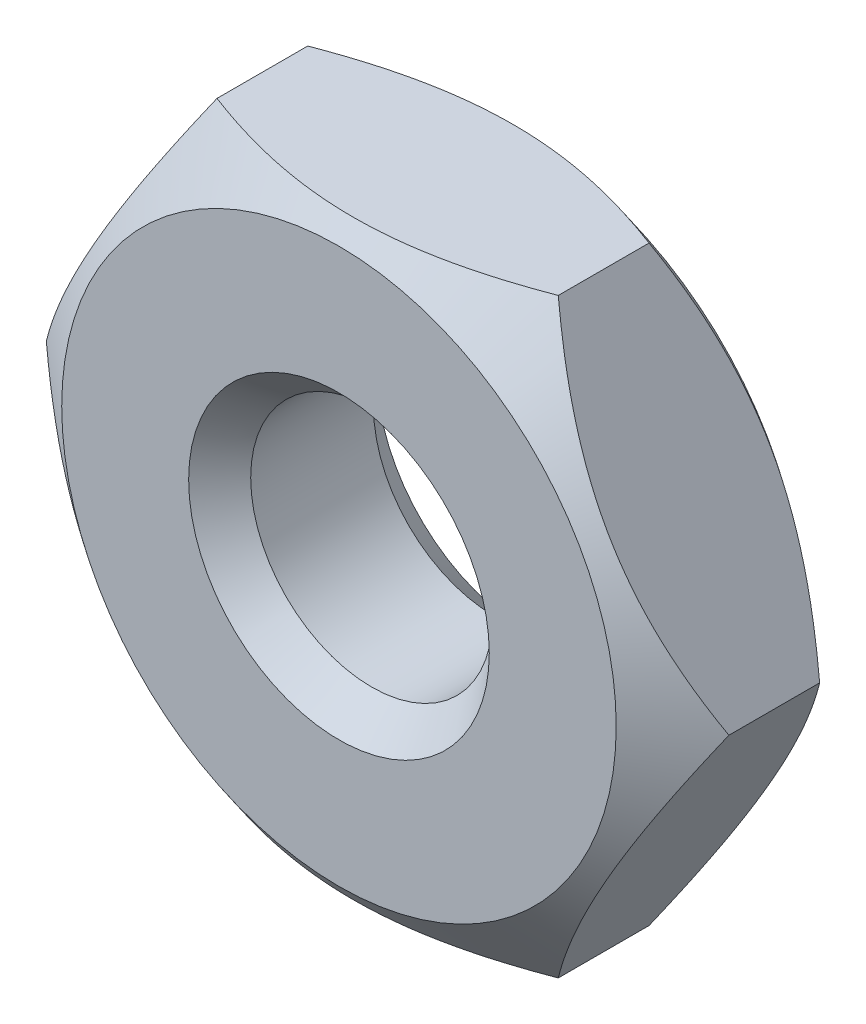
ISO-10303-21;
HEADER;
FILE_DESCRIPTION(('STEP AP214'),'2;1');
FILE_NAME('part.step','',(''),(''),'','','');
FILE_SCHEMA(('AUTOMOTIVE_DESIGN { 1 0 10303 214 1 1 1 1 }'));
ENDSEC;
DATA;
#1=APPLICATION_CONTEXT('core data for automotive mechanical design processes');
#2=APPLICATION_PROTOCOL_DEFINITION('international standard','automotive_design',2000,#1);
#3=PRODUCT_CONTEXT('',#1,'mechanical');
#4=PRODUCT('Part','Part','',(#3));
#5=PRODUCT_RELATED_PRODUCT_CATEGORY('part','',(#4));
#6=PRODUCT_DEFINITION_FORMATION('','',#4);
#7=PRODUCT_DEFINITION_CONTEXT('part definition',#1,'design');
#8=PRODUCT_DEFINITION('design','',#6,#7);
#9=PRODUCT_DEFINITION_SHAPE('','',#8);
#10=(LENGTH_UNIT() NAMED_UNIT(*) SI_UNIT(.MILLI.,.METRE.));
#11=(NAMED_UNIT(*) PLANE_ANGLE_UNIT() SI_UNIT($,.RADIAN.));
#12=(NAMED_UNIT(*) SI_UNIT($,.STERADIAN.) SOLID_ANGLE_UNIT());
#13=UNCERTAINTY_MEASURE_WITH_UNIT(LENGTH_MEASURE(1.E-05),#10,'distance_accuracy_value','');
#14=(GEOMETRIC_REPRESENTATION_CONTEXT(3) GLOBAL_UNCERTAINTY_ASSIGNED_CONTEXT((#13)) GLOBAL_UNIT_ASSIGNED_CONTEXT((#10,
#11,#12)) REPRESENTATION_CONTEXT('',''));
#15=CARTESIAN_POINT('',(0.,0.,0.));
#16=DIRECTION('',(0.,0.,1.));
#17=DIRECTION('',(1.,0.,0.));
#18=AXIS2_PLACEMENT_3D('',#15,#16,#17);
#19=CARTESIAN_POINT('',(0.,0.,0.875));
#20=DIRECTION('',(0.,0.,-1.));
#21=DIRECTION('',(-1.,0.,0.));
#22=AXIS2_PLACEMENT_3D('',#19,#20,#21);
#23=CYLINDRICAL_SURFACE('',#22,1.125);
#24=CARTESIAN_POINT('',(0.,0.,-0.571309556089092));
#25=DIRECTION('',(0.,0.,-1.));
#26=DIRECTION('',(-1.,0.,0.));
#27=AXIS2_PLACEMENT_3D('',#24,#25,#26);
#28=CIRCLE('',#27,1.125);
#29=CARTESIAN_POINT('',(-1.125,0.,-0.571309556089092));
#30=VERTEX_POINT('',#29);
#31=EDGE_CURVE('E45',#30,#30,#28,.T.);
#32=ORIENTED_EDGE('',*,*,#31,.T.);
#33=EDGE_LOOP('',(#32));
#34=FACE_BOUND('',#33,.T.);
#35=CARTESIAN_POINT('',(0.,0.,0.571309556089092));
#36=DIRECTION('',(0.,0.,1.));
#37=DIRECTION('',(1.,0.,0.));
#38=AXIS2_PLACEMENT_3D('',#35,#36,#37);
#39=CIRCLE('',#38,1.125);
#40=CARTESIAN_POINT('',(1.125,0.,0.571309556089092));
#41=VERTEX_POINT('',#40);
#42=EDGE_CURVE('E253',#41,#41,#39,.T.);
#43=ORIENTED_EDGE('',*,*,#42,.T.);
#44=EDGE_LOOP('',(#43));
#45=FACE_BOUND('',#44,.T.);
#46=ADVANCED_FACE('F40',(#34,#45),#23,.F.);
#47=CARTESIAN_POINT('',(3.17542648054294,0.,0.875));
#48=DIRECTION('',(0.,0.,1.));
#49=DIRECTION('',(1.,0.,0.));
#50=AXIS2_PLACEMENT_3D('',#47,#48,#49);
#51=PLANE('',#50);
#52=CARTESIAN_POINT('',(0.,0.,0.875));
#53=DIRECTION('',(0.,0.,-1.));
#54=DIRECTION('',(-1.,0.,0.));
#55=AXIS2_PLACEMENT_3D('',#52,#53,#54);
#56=CIRCLE('',#55,2.57967565803126);
#57=CARTESIAN_POINT('',(-2.57967565803126,0.,0.875));
#58=VERTEX_POINT('',#57);
#59=EDGE_CURVE('E160',#58,#58,#56,.T.);
#60=ORIENTED_EDGE('',*,*,#59,.F.);
#61=EDGE_LOOP('',(#60));
#62=FACE_BOUND('',#61,.T.);
#63=CARTESIAN_POINT('',(0.,0.,0.875));
#64=DIRECTION('',(0.,0.,-1.));
#65=DIRECTION('',(-1.,0.,0.));
#66=AXIS2_PLACEMENT_3D('',#63,#64,#65);
#67=CIRCLE('',#66,1.39869882225736);
#68=CARTESIAN_POINT('',(-1.39869882225736,0.,0.875));
#69=VERTEX_POINT('',#68);
#70=EDGE_CURVE('E255',#69,#69,#67,.T.);
#71=ORIENTED_EDGE('',*,*,#70,.T.);
#72=EDGE_LOOP('',(#71));
#73=FACE_BOUND('',#72,.T.);
#74=ADVANCED_FACE('F261',(#62,#73),#51,.T.);
#75=CARTESIAN_POINT('',(3.17542648054294,0.,-0.875));
#76=DIRECTION('',(0.,0.,1.));
#77=DIRECTION('',(1.,0.,0.));
#78=AXIS2_PLACEMENT_3D('',#75,#76,#77);
#79=PLANE('',#78);
#80=CARTESIAN_POINT('',(0.,0.,-0.875));
#81=DIRECTION('',(0.,0.,-1.));
#82=DIRECTION('',(-1.,0.,0.));
#83=AXIS2_PLACEMENT_3D('',#80,#81,#82);
#84=CIRCLE('',#83,2.57967565803126);
#85=CARTESIAN_POINT('',(-2.57967565803126,0.,-0.875));
#86=VERTEX_POINT('',#85);
#87=EDGE_CURVE('E237',#86,#86,#84,.T.);
#88=ORIENTED_EDGE('',*,*,#87,.T.);
#89=EDGE_LOOP('',(#88));
#90=FACE_BOUND('',#89,.T.);
#91=CARTESIAN_POINT('',(0.,0.,-0.875));
#92=DIRECTION('',(0.,0.,-1.));
#93=DIRECTION('',(-1.,0.,0.));
#94=AXIS2_PLACEMENT_3D('',#91,#92,#93);
#95=CIRCLE('',#94,1.39869882225736);
#96=CARTESIAN_POINT('',(-1.39869882225736,0.,-0.875));
#97=VERTEX_POINT('',#96);
#98=EDGE_CURVE('E250',#97,#97,#95,.T.);
#99=ORIENTED_EDGE('',*,*,#98,.F.);
#100=EDGE_LOOP('',(#99));
#101=FACE_BOUND('',#100,.T.);
#102=ADVANCED_FACE('F148',(#90,#101),#79,.F.);
#103=CARTESIAN_POINT('',(1.58771324027147,-2.75000000000001,0.875));
#104=DIRECTION('',(-0.866025403784439,0.499999999999999,0.));
#105=DIRECTION('',(-0.499999999999999,-0.866025403784439,0.));
#106=AXIS2_PLACEMENT_3D('',#103,#104,#105);
#107=PLANE('',#106);
#108=CARTESIAN_POINT('',(1.58759777021763,-2.75020000000001,0.422160942777373));
#109=CARTESIAN_POINT('',(1.64550190352809,-2.64990709913805,0.466154780551173));
#110=CARTESIAN_POINT('',(1.70405943349325,-2.54848248207265,0.507070178691369));
#111=CARTESIAN_POINT('',(1.82260090158642,-2.34316263653149,0.580973640943661));
#112=CARTESIAN_POINT('',(1.88258869751745,-2.23926072614486,0.613936747312));
#113=CARTESIAN_POINT('',(2.00316905185835,-2.03040942603176,0.66960053153298));
#114=CARTESIAN_POINT('',(2.06375027487333,-1.92547966978516,0.692396697396892));
#115=CARTESIAN_POINT('',(2.18566156560971,-1.71432312021345,0.726413038406155));
#116=CARTESIAN_POINT('',(2.24699060375779,-1.60809811016164,0.737647633324384));
#117=CARTESIAN_POINT('',(2.3707861439042,-1.39367794487763,0.747635248589356));
#118=CARTESIAN_POINT('',(2.43325640751754,-1.28547627433711,0.746208259178316));
#119=CARTESIAN_POINT('',(2.55781965199881,-1.06972640613992,0.730576516202646));
#120=CARTESIAN_POINT('',(2.61991239822633,-0.962178614892368,0.716364499930269));
#121=CARTESIAN_POINT('',(2.74313096480059,-0.748757797149943,0.676454709858134));
#122=CARTESIAN_POINT('',(2.80425695401586,-0.642884478166186,0.650758965445119));
#123=CARTESIAN_POINT('',(2.92526615114008,-0.43329040056392,0.589785702787514));
#124=CARTESIAN_POINT('',(2.98514965998825,-0.329569120703398,0.554510534623646));
#125=CARTESIAN_POINT('',(3.06644185932183,-0.188766901198609,0.500857372308921));
#126=CARTESIAN_POINT('',(3.08841054852007,-0.150716015331571,0.485768789486151));
#127=CARTESIAN_POINT('',(3.13212735753987,-0.0749962809644953,0.45465279438258));
#128=CARTESIAN_POINT('',(3.15387585349002,-0.0373267809906328,0.438627497973258));
#129=CARTESIAN_POINT('',(3.17554195059678,0.000200000000000198,0.42216094277738));
#130=B_SPLINE_CURVE_WITH_KNOTS('',3,(#108,#109,#110,#111,#112,#113,#114,#115,#116,#117,#118,
#119,#120,#121,#122,#123,#124,#125,#126,#127,#128,#129),.UNSPECIFIED.,.F.,.F.,(4,2,2,2,2,2,2,2,
2,2,4),(0.,0.371799405419223,0.744750925949884,1.11412185714032,1.4830315427207,
1.85719432965493,2.23156979914087,2.60587913571533,2.98009672734276,3.11945764890091,
3.2585151082062),.UNSPECIFIED.);
#131=CARTESIAN_POINT('',(1.58771324027145,-2.75000000000001,0.422248701058826));
#132=VERTEX_POINT('',#131);
#133=CARTESIAN_POINT('',(3.17542648054294,0.,0.422248701058826));
#134=VERTEX_POINT('',#133);
#135=EDGE_CURVE('E195',#132,#134,#130,.T.);
#136=ORIENTED_EDGE('',*,*,#135,.F.);
#137=DIRECTION('',(0.,0.,-1.));
#138=VECTOR('',#137,1.);
#139=CARTESIAN_POINT('',(1.58771324027147,-2.75000000000001,0.875));
#140=LINE('',#139,#138);
#141=CARTESIAN_POINT('',(1.58771324027147,-2.75000000000001,-0.42224870105882));
#142=VERTEX_POINT('',#141);
#143=EDGE_CURVE('E66',#132,#142,#140,.T.);
#144=ORIENTED_EDGE('',*,*,#143,.T.);
#145=CARTESIAN_POINT('',(3.17554195059678,0.0002,-0.42216094277738));
#146=CARTESIAN_POINT('',(3.11763781728632,-0.100092900861959,-0.466154780551179));
#147=CARTESIAN_POINT('',(3.05908028732116,-0.201517517927356,-0.507070178691375));
#148=CARTESIAN_POINT('',(2.940538819228,-0.406837363468517,-0.580973640943666));
#149=CARTESIAN_POINT('',(2.88055102329696,-0.510739273855143,-0.613936747312004));
#150=CARTESIAN_POINT('',(2.75997066895606,-0.719590573968245,-0.669600531532983));
#151=CARTESIAN_POINT('',(2.69938944594108,-0.824520330214851,-0.692396697396895));
#152=CARTESIAN_POINT('',(2.5774781552047,-1.03567687978656,-0.726413038406157));
#153=CARTESIAN_POINT('',(2.51614911705662,-1.14190188983837,-0.737647633324385));
#154=CARTESIAN_POINT('',(2.39235357691021,-1.35632205512237,-0.747635248589356));
#155=CARTESIAN_POINT('',(2.32988331329688,-1.4645237256629,-0.746208259178315));
#156=CARTESIAN_POINT('',(2.20532006881561,-1.68027359386008,-0.730576516202645));
#157=CARTESIAN_POINT('',(2.14322732258808,-1.78782138510764,-0.716364499930268));
#158=CARTESIAN_POINT('',(2.02000875601382,-2.00124220285006,-0.676454709858132));
#159=CARTESIAN_POINT('',(1.95888276679855,-2.10711552183382,-0.650758965445117));
#160=CARTESIAN_POINT('',(1.83787356967433,-2.31670959943608,-0.589785702787512));
#161=CARTESIAN_POINT('',(1.77799006082617,-2.4204308792966,-0.554510534623644));
#162=CARTESIAN_POINT('',(1.69669786149258,-2.56123309880139,-0.500857372308919));
#163=CARTESIAN_POINT('',(1.67472917229434,-2.59928398466843,-0.485768789486148));
#164=CARTESIAN_POINT('',(1.63101236327454,-2.67500371903551,-0.454652794382575));
#165=CARTESIAN_POINT('',(1.60926386732439,-2.71267321900938,-0.438627497973252));
#166=CARTESIAN_POINT('',(1.58759777021763,-2.75020000000001,-0.422160942777374));
#167=B_SPLINE_CURVE_WITH_KNOTS('',3,(#145,#146,#147,#148,#149,#150,#151,#152,#153,#154,#155,
#156,#157,#158,#159,#160,#161,#162,#163,#164,#165,#166),.UNSPECIFIED.,.F.,.F.,(4,2,2,2,2,2,2,2,
2,2,4),(0.,0.371799405419222,0.744750925949881,1.11412185714032,1.4830315427207,
1.85719432965492,2.23156979914086,2.60587913571532,2.98009672734275,3.11945764890091,
3.2585151082062),.UNSPECIFIED.);
#168=CARTESIAN_POINT('',(3.17542648054294,0.,-0.422248701058826));
#169=VERTEX_POINT('',#168);
#170=EDGE_CURVE('E218',#169,#142,#167,.T.);
#171=ORIENTED_EDGE('',*,*,#170,.F.);
#172=DIRECTION('',(0.,0.,-1.));
#173=VECTOR('',#172,1.);
#174=CARTESIAN_POINT('',(3.17542648054294,0.,0.875));
#175=LINE('',#174,#173);
#176=EDGE_CURVE('E51',#134,#169,#175,.T.);
#177=ORIENTED_EDGE('',*,*,#176,.F.);
#178=EDGE_LOOP('',(#136,#144,#171,#177));
#179=FACE_BOUND('',#178,.T.);
#180=ADVANCED_FACE('F42',(#179),#107,.F.);
#181=CARTESIAN_POINT('',(3.17542648054294,0.,0.875));
#182=DIRECTION('',(-0.86602540378444,-0.499999999999998,0.));
#183=DIRECTION('',(0.499999999999998,-0.86602540378444,0.));
#184=AXIS2_PLACEMENT_3D('',#181,#182,#183);
#185=PLANE('',#184);
#186=CARTESIAN_POINT('',(3.17554195059678,-0.000200000000000048,0.42216094277738));
#187=CARTESIAN_POINT('',(3.11763781728632,0.100092900861959,0.466154780551179));
#188=CARTESIAN_POINT('',(3.05908028732116,0.201517517927356,0.507070178691375));
#189=CARTESIAN_POINT('',(2.940538819228,0.406837363468517,0.580973640943666));
#190=CARTESIAN_POINT('',(2.88055102329696,0.510739273855144,0.613936747312004));
#191=CARTESIAN_POINT('',(2.75997066895606,0.719590573968245,0.669600531532982));
#192=CARTESIAN_POINT('',(2.69938944594108,0.824520330214851,0.692396697396894));
#193=CARTESIAN_POINT('',(2.5774781552047,1.03567687978656,0.726413038406156));
#194=CARTESIAN_POINT('',(2.51614911705662,1.14190188983837,0.737647633324384));
#195=CARTESIAN_POINT('',(2.39235357691022,1.35632205512238,0.747635248589355));
#196=CARTESIAN_POINT('',(2.32988331329688,1.4645237256629,0.746208259178314));
#197=CARTESIAN_POINT('',(2.20532006881561,1.68027359386008,0.730576516202643));
#198=CARTESIAN_POINT('',(2.14322732258808,1.78782138510764,0.716364499930266));
#199=CARTESIAN_POINT('',(2.02000875601383,2.00124220285006,0.67645470985813));
#200=CARTESIAN_POINT('',(1.95888276679856,2.10711552183382,0.650758965445115));
#201=CARTESIAN_POINT('',(1.83787356967434,2.31670959943608,0.58978570278751));
#202=CARTESIAN_POINT('',(1.77799006082617,2.4204308792966,0.554510534623642));
#203=CARTESIAN_POINT('',(1.69669786149259,2.56123309880139,0.500857372308917));
#204=CARTESIAN_POINT('',(1.67472917229435,2.59928398466843,0.485768789486145));
#205=CARTESIAN_POINT('',(1.63101236327455,2.67500371903552,0.454652794382572));
#206=CARTESIAN_POINT('',(1.6092638673244,2.71267321900938,0.438627497973248));
#207=CARTESIAN_POINT('',(1.58759777021763,2.75020000000002,0.422160942777369));
#208=B_SPLINE_CURVE_WITH_KNOTS('',3,(#186,#187,#188,#189,#190,#191,#192,#193,#194,#195,#196,
#197,#198,#199,#200,#201,#202,#203,#204,#205,#206,#207),.UNSPECIFIED.,.F.,.F.,(4,2,2,2,2,2,2,2,
2,2,4),(0.,0.371799405419221,0.744750925949881,1.11412185714032,1.4830315427207,
1.85719432965492,2.23156979914086,2.60587913571532,2.98009672734275,3.11945764890091,
3.2585151082062),.UNSPECIFIED.);
#209=CARTESIAN_POINT('',(1.58771324027144,2.75000000000002,0.422248701058826));
#210=VERTEX_POINT('',#209);
#211=EDGE_CURVE('E189',#134,#210,#208,.T.);
#212=ORIENTED_EDGE('',*,*,#211,.F.);
#213=ORIENTED_EDGE('',*,*,#176,.T.);
#214=CARTESIAN_POINT('',(1.58759777021763,2.75020000000002,-0.422160942777368));
#215=CARTESIAN_POINT('',(1.64550190352809,2.64990709913806,-0.466154780551169));
#216=CARTESIAN_POINT('',(1.70405943349325,2.54848248207266,-0.507070178691365));
#217=CARTESIAN_POINT('',(1.82260090158642,2.3431626365315,-0.580973640943658));
#218=CARTESIAN_POINT('',(1.88258869751745,2.23926072614487,-0.613936747311997));
#219=CARTESIAN_POINT('',(2.00316905185835,2.03040942603177,-0.669600531532977));
#220=CARTESIAN_POINT('',(2.06375027487333,1.92547966978516,-0.69239669739689));
#221=CARTESIAN_POINT('',(2.18566156560971,1.71432312021345,-0.726413038406153));
#222=CARTESIAN_POINT('',(2.24699060375779,1.60809811016164,-0.737647633324382));
#223=CARTESIAN_POINT('',(2.3707861439042,1.39367794487763,-0.747635248589355));
#224=CARTESIAN_POINT('',(2.43325640751754,1.28547627433711,-0.746208259178315));
#225=CARTESIAN_POINT('',(2.55781965199881,1.06972640613993,-0.730576516202645));
#226=CARTESIAN_POINT('',(2.61991239822633,0.962178614892368,-0.716364499930268));
#227=CARTESIAN_POINT('',(2.74313096480059,0.748757797149942,-0.676454709858133));
#228=CARTESIAN_POINT('',(2.80425695401586,0.642884478166185,-0.650758965445118));
#229=CARTESIAN_POINT('',(2.92526615114008,0.433290400563918,-0.589785702787513));
#230=CARTESIAN_POINT('',(2.98514965998825,0.329569120703396,-0.554510534623645));
#231=CARTESIAN_POINT('',(3.06644185932183,0.188766901198607,-0.500857372308921));
#232=CARTESIAN_POINT('',(3.08841054852007,0.15071601533157,-0.485768789486151));
#233=CARTESIAN_POINT('',(3.13212735753987,0.0749962809644946,-0.45465279438258));
#234=CARTESIAN_POINT('',(3.15387585349002,0.0373267809906325,-0.438627497973258));
#235=CARTESIAN_POINT('',(3.17554195059678,-0.000200000000000123,-0.42216094277738));
#236=B_SPLINE_CURVE_WITH_KNOTS('',3,(#214,#215,#216,#217,#218,#219,#220,#221,#222,#223,#224,
#225,#226,#227,#228,#229,#230,#231,#232,#233,#234,#235),.UNSPECIFIED.,.F.,.F.,(4,2,2,2,2,2,2,2,
2,2,4),(0.,0.371799405419223,0.744750925949886,1.11412185714033,1.48303154272071,
1.85719432965493,2.23156979914087,2.60587913571534,2.98009672734277,3.11945764890092,
3.2585151082062),.UNSPECIFIED.);
#237=CARTESIAN_POINT('',(1.58771324027144,2.75000000000002,-0.422248701058826));
#238=VERTEX_POINT('',#237);
#239=EDGE_CURVE('E209',#238,#169,#236,.T.);
#240=ORIENTED_EDGE('',*,*,#239,.F.);
#241=DIRECTION('',(0.,0.,-1.));
#242=VECTOR('',#241,1.);
#243=CARTESIAN_POINT('',(1.58771324027147,2.75000000000002,0.875));
#244=LINE('',#243,#242);
#245=EDGE_CURVE('E124',#210,#238,#244,.T.);
#246=ORIENTED_EDGE('',*,*,#245,.F.);
#247=EDGE_LOOP('',(#212,#213,#240,#246));
#248=FACE_BOUND('',#247,.T.);
#249=ADVANCED_FACE('F201',(#248),#185,.F.);
#250=CARTESIAN_POINT('',(1.58771324027147,2.75000000000002,0.875));
#251=DIRECTION('',(0.,-1.,0.));
#252=DIRECTION('',(1.,0.,0.));
#253=AXIS2_PLACEMENT_3D('',#250,#251,#252);
#254=PLANE('',#253);
#255=CARTESIAN_POINT('',(-3.67639026227045,2.75000000000001,-0.653629345424159));
#256=CARTESIAN_POINT('',(-3.57939501129828,2.75000000000001,-0.594617392693888));
#257=CARTESIAN_POINT('',(-3.48203582798054,2.75000000000001,-0.536193521287553));
#258=CARTESIAN_POINT('',(-3.28642450050147,2.75000000000001,-0.42081469241309));
#259=CARTESIAN_POINT('',(-3.18817217412981,2.75000000000001,-0.36386004420957));
#260=CARTESIAN_POINT('',(-2.98999312864294,2.75000000000001,-0.251364526704245));
#261=CARTESIAN_POINT('',(-2.89005961993059,2.75000000000001,-0.195835576816778));
#262=CARTESIAN_POINT('',(-2.68898605542339,2.75000000000001,-0.0870141128607656));
#263=CARTESIAN_POINT('',(-2.58784607099461,2.75000000000001,-0.0337214673434778));
#264=CARTESIAN_POINT('',(-2.37960467735443,2.75000000000001,0.072406444143973));
#265=CARTESIAN_POINT('',(-2.27243853410877,2.75000000000001,0.125115368284265));
#266=CARTESIAN_POINT('',(-2.05628130729264,2.75000000000001,0.22671280170422));
#267=CARTESIAN_POINT('',(-1.94728998776978,2.75000000000001,0.275600812327037));
#268=CARTESIAN_POINT('',(-1.72750553308581,2.75000000000001,0.368389098401357));
#269=CARTESIAN_POINT('',(-1.61671756350507,2.75000000000001,0.412301496884643));
#270=CARTESIAN_POINT('',(-1.39290793086001,2.75000000000001,0.493947856122555));
#271=CARTESIAN_POINT('',(-1.27988710994013,2.75000000000001,0.531684098243662));
#272=CARTESIAN_POINT('',(-1.04800611827853,2.75000000000001,0.600456106444395));
#273=CARTESIAN_POINT('',(-0.929073172911555,2.75000000000001,0.631250828500203));
#274=CARTESIAN_POINT('',(-0.689007289038234,2.75000000000001,0.682735436264609));
#275=CARTESIAN_POINT('',(-0.56787464028896,2.75000000000001,0.703426642992347));
#276=CARTESIAN_POINT('',(-0.326182637619097,2.75000000000001,0.732827144583061));
#277=CARTESIAN_POINT('',(-0.205647505779988,2.75000000000001,0.741730810434299));
#278=CARTESIAN_POINT('',(0.0357156540375103,2.75000000000001,0.747392674786314));
#279=CARTESIAN_POINT('',(0.156543674845617,2.75000000000002,0.744151167673998));
#280=CARTESIAN_POINT('',(0.388111009280242,2.75000000000002,0.726527441798538));
#281=CARTESIAN_POINT('',(0.498918749822064,2.75000000000002,0.713011218969894));
#282=CARTESIAN_POINT('',(0.719012011841308,2.75000000000002,0.676851287726835));
#283=CARTESIAN_POINT('',(0.828297434040084,2.75000000000002,0.654206986877306));
#284=CARTESIAN_POINT('',(1.04701988751654,2.75000000000002,0.600620685026126));
#285=CARTESIAN_POINT('',(1.15641934493609,2.75000000000002,0.569527353115695));
#286=CARTESIAN_POINT('',(1.31890175806598,2.75000000000002,0.517932490777469));
#287=CARTESIAN_POINT('',(1.37279205976384,2.75000000000002,0.499908794444988));
#288=CARTESIAN_POINT('',(1.48005179464635,2.75000000000002,0.462375966007029));
#289=CARTESIAN_POINT('',(1.53342124441932,2.75000000000002,0.442866881384174));
#290=CARTESIAN_POINT('',(1.69029471405982,2.75000000000002,0.383292278875777));
#291=CARTESIAN_POINT('',(1.79309120578908,2.75000000000002,0.341359692569031));
#292=CARTESIAN_POINT('',(1.99694995326802,2.75000000000002,0.253451046332255));
#293=CARTESIAN_POINT('',(2.09801178771731,2.75000000000002,0.207474020272746));
#294=CARTESIAN_POINT('',(2.29867974831897,2.75000000000002,0.112252563995711));
#295=CARTESIAN_POINT('',(2.39828460282512,2.75000000000002,0.0630054657224356));
#296=CARTESIAN_POINT('',(2.59616650348701,2.75000000000002,-0.0380950463402421));
#297=CARTESIAN_POINT('',(2.69444343409318,2.75000000000002,-0.0899486851087005));
#298=CARTESIAN_POINT('',(2.98844733565992,2.75000000000002,-0.249122310723766));
#299=CARTESIAN_POINT('',(3.18245250184789,2.75000000000002,-0.359619066196852));
#300=CARTESIAN_POINT('',(3.56701552268731,2.75000000000002,-0.586193844526677));
#301=CARTESIAN_POINT('',(3.75757489705958,2.75000000000002,-0.702269320040532));
#302=CARTESIAN_POINT('',(4.11730397019956,2.75000000000002,-0.92657892884701));
#303=CARTESIAN_POINT('',(4.28670850108432,2.75000000000002,-1.03443778276285));
#304=CARTESIAN_POINT('',(4.62398914916442,2.75000000000002,-1.25255831219244));
#305=CARTESIAN_POINT('',(4.79186507188298,2.75000000000002,-1.36282028755043));
#306=CARTESIAN_POINT('',(5.12475753602754,2.75000000000002,-1.58406458188025));
#307=CARTESIAN_POINT('',(5.28978595014131,2.75000000000002,-1.69502907875624));
#308=CARTESIAN_POINT('',(5.61885275626859,2.75000000000002,-1.91834687055425));
#309=CARTESIAN_POINT('',(5.78289134049976,2.75000000000002,-2.03069988201465));
#310=CARTESIAN_POINT('',(5.94656625671991,2.75000000000002,-2.14357353525307));
#311=B_SPLINE_CURVE_WITH_KNOTS('',3,(#255,#256,#257,#258,#259,#260,#261,#262,#263,#264,#265,
#266,#267,#268,#269,#270,#271,#272,#273,#274,#275,#276,#277,#278,#279,#280,#281,#282,#283,#284,
#285,#286,#287,#288,#289,#290,#291,#292,#293,#294,#295,#296,#297,#298,#299,#300,#301,#302,#303,
#304,#305,#306,#307,#308,#309,#310),.UNSPECIFIED.,.F.,.F.,(4,2,2,2,2,2,2,2,2,2,2,2,2,2,2,2,2,2,
2,2,2,2,2,2,2,2,2,4),(0.,0.340614587055066,0.681300296316607,1.02425142553785,1.36718236796196,
1.72540375915339,2.08367182303179,2.44104729484458,2.79829045887623,3.16649200909567,
3.53464540462769,3.89664921580122,4.25864425241936,4.59310965285521,4.92759676442877,
5.26852236145616,5.43897847754409,5.60942914703719,5.9423693756515,6.27538935361335,
6.60868446335739,6.94200839045796,7.61163970232217,8.28096810096076,8.88342208827953,
9.48595168076807,10.0825403558946,10.679009187391),.UNSPECIFIED.);
#312=CARTESIAN_POINT('',(-1.58771324027148,2.75,0.422248701058826));
#313=VERTEX_POINT('',#312);
#314=EDGE_CURVE('E99',#210,#313,#311,.F.);
#315=ORIENTED_EDGE('',*,*,#314,.F.);
#316=ORIENTED_EDGE('',*,*,#245,.T.);
#317=CARTESIAN_POINT('',(-3.67639026227045,2.75000000000001,0.653629345424161));
#318=CARTESIAN_POINT('',(-3.57939501129829,2.75000000000001,0.59461739269389));
#319=CARTESIAN_POINT('',(-3.48203582798055,2.75000000000001,0.536193521287554));
#320=CARTESIAN_POINT('',(-3.28642450050147,2.75000000000001,0.420814692413091));
#321=CARTESIAN_POINT('',(-3.18817217412981,2.75000000000001,0.363860044209571));
#322=CARTESIAN_POINT('',(-2.98999312864294,2.75000000000001,0.251364526704245));
#323=CARTESIAN_POINT('',(-2.89005961993059,2.75000000000001,0.195835576816778));
#324=CARTESIAN_POINT('',(-2.6889860554234,2.75000000000001,0.0870141128607663));
#325=CARTESIAN_POINT('',(-2.58784607099461,2.75000000000001,0.033721467343479));
#326=CARTESIAN_POINT('',(-2.37960467735444,2.75000000000001,-0.0724064441439715));
#327=CARTESIAN_POINT('',(-2.27243853410877,2.75000000000001,-0.125115368284264));
#328=CARTESIAN_POINT('',(-2.05628130729264,2.75000000000001,-0.226712801704219));
#329=CARTESIAN_POINT('',(-1.94728998776979,2.75000000000001,-0.275600812327036));
#330=CARTESIAN_POINT('',(-1.72750553308582,2.75000000000001,-0.368389098401357));
#331=CARTESIAN_POINT('',(-1.61671756350507,2.75000000000001,-0.412301496884643));
#332=CARTESIAN_POINT('',(-1.39290793086001,2.75000000000001,-0.493947856122555));
#333=CARTESIAN_POINT('',(-1.27988710994014,2.75000000000001,-0.531684098243662));
#334=CARTESIAN_POINT('',(-1.04800611827853,2.75000000000001,-0.600456106444395));
#335=CARTESIAN_POINT('',(-0.929073172911555,2.75000000000001,-0.631250828500203));
#336=CARTESIAN_POINT('',(-0.689007289038234,2.75000000000001,-0.682735436264609));
#337=CARTESIAN_POINT('',(-0.567874640288959,2.75000000000001,-0.703426642992347));
#338=CARTESIAN_POINT('',(-0.326182637619096,2.75000000000001,-0.732827144583061));
#339=CARTESIAN_POINT('',(-0.205647505779987,2.75000000000001,-0.741730810434299));
#340=CARTESIAN_POINT('',(0.0357156540375112,2.75000000000001,-0.747392674786314));
#341=CARTESIAN_POINT('',(0.156543674845618,2.75000000000002,-0.744151167673998));
#342=CARTESIAN_POINT('',(0.388111009280243,2.75000000000002,-0.726527441798539));
#343=CARTESIAN_POINT('',(0.498918749822065,2.75000000000002,-0.713011218969895));
#344=CARTESIAN_POINT('',(0.719012011841309,2.75000000000002,-0.676851287726835));
#345=CARTESIAN_POINT('',(0.828297434040084,2.75000000000002,-0.654206986877306));
#346=CARTESIAN_POINT('',(1.04701988751654,2.75000000000002,-0.600620685026125));
#347=CARTESIAN_POINT('',(1.15641934493609,2.75000000000002,-0.569527353115695));
#348=CARTESIAN_POINT('',(1.31890175806598,2.75000000000002,-0.517932490777469));
#349=CARTESIAN_POINT('',(1.37279205976384,2.75000000000002,-0.499908794444988));
#350=CARTESIAN_POINT('',(1.48005179464635,2.75000000000002,-0.462375966007028));
#351=CARTESIAN_POINT('',(1.53342124441933,2.75000000000002,-0.442866881384174));
#352=CARTESIAN_POINT('',(1.69029471405982,2.75000000000002,-0.383292278875777));
#353=CARTESIAN_POINT('',(1.79309120578908,2.75000000000002,-0.34135969256903));
#354=CARTESIAN_POINT('',(1.99694995326802,2.75000000000002,-0.253451046332254));
#355=CARTESIAN_POINT('',(2.09801178771731,2.75000000000002,-0.207474020272744));
#356=CARTESIAN_POINT('',(2.29867974831898,2.75000000000002,-0.112252563995709));
#357=CARTESIAN_POINT('',(2.39828460282513,2.75000000000002,-0.0630054657224342));
#358=CARTESIAN_POINT('',(2.59616650348701,2.75000000000002,0.0380950463402438));
#359=CARTESIAN_POINT('',(2.69444343409319,2.75000000000002,0.0899486851087025));
#360=CARTESIAN_POINT('',(2.98844733565993,2.75000000000002,0.249122310723768));
#361=CARTESIAN_POINT('',(3.18245250184789,2.75000000000002,0.359619066196855));
#362=CARTESIAN_POINT('',(3.56701552268731,2.75000000000002,0.58619384452668));
#363=CARTESIAN_POINT('',(3.75757489705958,2.75000000000002,0.702269320040535));
#364=CARTESIAN_POINT('',(4.11730397019957,2.75000000000002,0.926578928847013));
#365=CARTESIAN_POINT('',(4.28670850108433,2.75000000000002,1.03443778276286));
#366=CARTESIAN_POINT('',(4.62398914916442,2.75000000000002,1.25255831219245));
#367=CARTESIAN_POINT('',(4.79186507188299,2.75000000000002,1.36282028755043));
#368=CARTESIAN_POINT('',(5.12475753602755,2.75000000000002,1.58406458188026));
#369=CARTESIAN_POINT('',(5.28978595014132,2.75000000000002,1.69502907875624));
#370=CARTESIAN_POINT('',(5.61885275626859,2.75000000000002,1.91834687055426));
#371=CARTESIAN_POINT('',(5.78289134049977,2.75000000000002,2.03069988201466));
#372=CARTESIAN_POINT('',(5.94656625671992,2.75000000000002,2.14357353525308));
#373=B_SPLINE_CURVE_WITH_KNOTS('',3,(#317,#318,#319,#320,#321,#322,#323,#324,#325,#326,#327,
#328,#329,#330,#331,#332,#333,#334,#335,#336,#337,#338,#339,#340,#341,#342,#343,#344,#345,#346,
#347,#348,#349,#350,#351,#352,#353,#354,#355,#356,#357,#358,#359,#360,#361,#362,#363,#364,#365,
#366,#367,#368,#369,#370,#371,#372),.UNSPECIFIED.,.F.,.F.,(4,2,2,2,2,2,2,2,2,2,2,2,2,2,2,2,2,2,
2,2,2,2,2,2,2,2,2,4),(0.,0.340614587055067,0.681300296316607,1.02425142553786,1.36718236796196,
1.72540375915339,2.08367182303179,2.44104729484458,2.79829045887623,3.16649200909567,
3.5346454046277,3.89664921580123,4.25864425241937,4.59310965285522,4.92759676442878,
5.26852236145616,5.43897847754409,5.60942914703719,5.9423693756515,6.27538935361336,
6.60868446335739,6.94200839045797,7.61163970232218,8.28096810096077,8.88342208827954,
9.48595168076808,10.0825403558947,10.679009187391),.UNSPECIFIED.);
#374=CARTESIAN_POINT('',(-1.58771324027148,2.75,-0.422248701058826));
#375=VERTEX_POINT('',#374);
#376=EDGE_CURVE('E219',#375,#238,#373,.T.);
#377=ORIENTED_EDGE('',*,*,#376,.F.);
#378=DIRECTION('',(0.,0.,-1.));
#379=VECTOR('',#378,1.);
#380=CARTESIAN_POINT('',(-1.58771324027147,2.75000000000001,0.875));
#381=LINE('',#380,#379);
#382=EDGE_CURVE('E120',#313,#375,#381,.T.);
#383=ORIENTED_EDGE('',*,*,#382,.F.);
#384=EDGE_LOOP('',(#315,#316,#377,#383));
#385=FACE_BOUND('',#384,.T.);
#386=ADVANCED_FACE('F204',(#385),#254,.F.);
#387=CARTESIAN_POINT('',(-1.58771324027147,2.75000000000001,0.875));
#388=DIRECTION('',(0.866025403784439,-0.499999999999999,0.));
#389=DIRECTION('',(0.499999999999999,0.866025403784439,0.));
#390=AXIS2_PLACEMENT_3D('',#387,#388,#389);
#391=PLANE('',#390);
#392=CARTESIAN_POINT('',(-1.58759777021763,2.75020000000001,0.422160942777372));
#393=CARTESIAN_POINT('',(-1.64550190352809,2.64990709913805,0.466154780551172));
#394=CARTESIAN_POINT('',(-1.70405943349325,2.54848248207266,0.507070178691369));
#395=CARTESIAN_POINT('',(-1.82260090158641,2.34316263653149,0.580973640943661));
#396=CARTESIAN_POINT('',(-1.88258869751745,2.23926072614487,0.613936747312));
#397=CARTESIAN_POINT('',(-2.00316905185835,2.03040942603177,0.66960053153298));
#398=CARTESIAN_POINT('',(-2.06375027487333,1.92547966978516,0.692396697396892));
#399=CARTESIAN_POINT('',(-2.18566156560971,1.71432312021345,0.726413038406155));
#400=CARTESIAN_POINT('',(-2.24699060375779,1.60809811016164,0.737647633324384));
#401=CARTESIAN_POINT('',(-2.3707861439042,1.39367794487763,0.747635248589356));
#402=CARTESIAN_POINT('',(-2.43325640751753,1.28547627433711,0.746208259178316));
#403=CARTESIAN_POINT('',(-2.55781965199881,1.06972640613993,0.730576516202646));
#404=CARTESIAN_POINT('',(-2.61991239822633,0.962178614892369,0.716364499930269));
#405=CARTESIAN_POINT('',(-2.74313096480059,0.748757797149944,0.676454709858134));
#406=CARTESIAN_POINT('',(-2.80425695401586,0.642884478166187,0.650758965445119));
#407=CARTESIAN_POINT('',(-2.92526615114008,0.433290400563921,0.589785702787514));
#408=CARTESIAN_POINT('',(-2.98514965998825,0.329569120703399,0.554510534623645));
#409=CARTESIAN_POINT('',(-3.06644185932183,0.188766901198608,0.500857372308921));
#410=CARTESIAN_POINT('',(-3.08841054852007,0.150716015331569,0.48576878948615));
#411=CARTESIAN_POINT('',(-3.13212735753987,0.0749962809644887,0.454652794382577));
#412=CARTESIAN_POINT('',(-3.15387585349002,0.0373267809906242,0.438627497973254));
#413=CARTESIAN_POINT('',(-3.17554195059679,-0.000200000000010635,0.422160942777375));
#414=B_SPLINE_CURVE_WITH_KNOTS('',3,(#392,#393,#394,#395,#396,#397,#398,#399,#400,#401,#402,
#403,#404,#405,#406,#407,#408,#409,#410,#411,#412,#413),.UNSPECIFIED.,.F.,.F.,(4,2,2,2,2,2,2,2,
2,2,4),(0.,0.371799405419224,0.744750925949885,1.11412185714033,1.48303154272071,
1.85719432965493,2.23156979914087,2.60587913571534,2.98009672734277,3.11945764890093,
3.25851510820622),.UNSPECIFIED.);
#415=CARTESIAN_POINT('',(-3.17542648054294,0.,0.422248701058826));
#416=VERTEX_POINT('',#415);
#417=EDGE_CURVE('E96',#313,#416,#414,.T.);
#418=ORIENTED_EDGE('',*,*,#417,.F.);
#419=ORIENTED_EDGE('',*,*,#382,.T.);
#420=CARTESIAN_POINT('',(-3.17554195059679,-0.000200000000010499,-0.422160942777375));
#421=CARTESIAN_POINT('',(-3.11763781728633,0.100092900861949,-0.466154780551175));
#422=CARTESIAN_POINT('',(-3.05908028732116,0.201517517927346,-0.507070178691371));
#423=CARTESIAN_POINT('',(-2.940538819228,0.406837363468507,-0.580973640943663));
#424=CARTESIAN_POINT('',(-2.88055102329697,0.510739273855134,-0.613936747312002));
#425=CARTESIAN_POINT('',(-2.75997066895606,0.719590573968236,-0.669600531532981));
#426=CARTESIAN_POINT('',(-2.69938944594108,0.824520330214842,-0.692396697396893));
#427=CARTESIAN_POINT('',(-2.57747815520471,1.03567687978655,-0.726413038406156));
#428=CARTESIAN_POINT('',(-2.51614911705662,1.14190188983836,-0.737647633324384));
#429=CARTESIAN_POINT('',(-2.39235357691022,1.35632205512237,-0.747635248589356));
#430=CARTESIAN_POINT('',(-2.32988331329688,1.46452372566289,-0.746208259178316));
#431=CARTESIAN_POINT('',(-2.20532006881561,1.68027359386007,-0.730576516202646));
#432=CARTESIAN_POINT('',(-2.14322732258808,1.78782138510763,-0.716364499930269));
#433=CARTESIAN_POINT('',(-2.02000875601383,2.00124220285005,-0.676454709858134));
#434=CARTESIAN_POINT('',(-1.95888276679855,2.10711552183381,-0.650758965445119));
#435=CARTESIAN_POINT('',(-1.83787356967434,2.31670959943608,-0.589785702787514));
#436=CARTESIAN_POINT('',(-1.77799006082617,2.4204308792966,-0.554510534623645));
#437=CARTESIAN_POINT('',(-1.69669786149258,2.56123309880139,-0.50085737230892));
#438=CARTESIAN_POINT('',(-1.67472917229434,2.59928398466843,-0.485768789486149));
#439=CARTESIAN_POINT('',(-1.63101236327454,2.67500371903551,-0.454652794382575));
#440=CARTESIAN_POINT('',(-1.60926386732439,2.71267321900938,-0.438627497973252));
#441=CARTESIAN_POINT('',(-1.58759777021763,2.75020000000001,-0.422160942777373));
#442=B_SPLINE_CURVE_WITH_KNOTS('',3,(#420,#421,#422,#423,#424,#425,#426,#427,#428,#429,#430,
#431,#432,#433,#434,#435,#436,#437,#438,#439,#440,#441),.UNSPECIFIED.,.F.,.F.,(4,2,2,2,2,2,2,2,
2,2,4),(0.,0.371799405419223,0.744750925949883,1.11412185714032,1.4830315427207,
1.85719432965493,2.23156979914086,2.60587913571533,2.98009672734276,3.11945764890092,
3.25851510820622),.UNSPECIFIED.);
#443=CARTESIAN_POINT('',(-3.17542648054294,0.,-0.422248701058826));
#444=VERTEX_POINT('',#443);
#445=EDGE_CURVE('E118',#444,#375,#442,.T.);
#446=ORIENTED_EDGE('',*,*,#445,.F.);
#447=DIRECTION('',(0.,0.,-1.));
#448=VECTOR('',#447,1.);
#449=CARTESIAN_POINT('',(-3.17542648054295,0.,0.875));
#450=LINE('',#449,#448);
#451=EDGE_CURVE('E109',#416,#444,#450,.T.);
#452=ORIENTED_EDGE('',*,*,#451,.F.);
#453=EDGE_LOOP('',(#418,#419,#446,#452));
#454=FACE_BOUND('',#453,.T.);
#455=ADVANCED_FACE('F116',(#454),#391,.F.);
#456=CARTESIAN_POINT('',(-3.17542648054295,0.,0.875));
#457=DIRECTION('',(0.866025403784438,0.500000000000001,0.));
#458=DIRECTION('',(-0.500000000000001,0.866025403784438,0.));
#459=AXIS2_PLACEMENT_3D('',#456,#457,#458);
#460=PLANE('',#459);
#461=CARTESIAN_POINT('',(-3.17554195059679,0.000199999999989635,0.422160942777374));
#462=CARTESIAN_POINT('',(-3.11763781728633,-0.10009290086197,0.466154780551174));
#463=CARTESIAN_POINT('',(-3.05908028732116,-0.201517517927367,0.50707017869137));
#464=CARTESIAN_POINT('',(-2.940538819228,-0.406837363468528,0.580973640943661));
#465=CARTESIAN_POINT('',(-2.88055102329697,-0.510739273855155,0.613936747311999));
#466=CARTESIAN_POINT('',(-2.75997066895606,-0.719590573968257,0.669600531532978));
#467=CARTESIAN_POINT('',(-2.69938944594108,-0.824520330214863,0.69239669739689));
#468=CARTESIAN_POINT('',(-2.5774781552047,-1.03567687978657,0.726413038406151));
#469=CARTESIAN_POINT('',(-2.51614911705662,-1.14190188983838,0.73764763332438));
#470=CARTESIAN_POINT('',(-2.39235357691022,-1.35632205512239,0.747635248589351));
#471=CARTESIAN_POINT('',(-2.32988331329688,-1.46452372566291,0.74620825917831));
#472=CARTESIAN_POINT('',(-2.20532006881561,-1.68027359386009,0.730576516202639));
#473=CARTESIAN_POINT('',(-2.14322732258808,-1.78782138510765,0.716364499930262));
#474=CARTESIAN_POINT('',(-2.02000875601382,-2.00124220285007,0.676454709858126));
#475=CARTESIAN_POINT('',(-1.95888276679855,-2.10711552183383,0.650758965445111));
#476=CARTESIAN_POINT('',(-1.83787356967433,-2.31670959943609,0.589785702787505));
#477=CARTESIAN_POINT('',(-1.77799006082617,-2.42043087929662,0.554510534623637));
#478=CARTESIAN_POINT('',(-1.69669786149258,-2.5612330988014,0.500857372308913));
#479=CARTESIAN_POINT('',(-1.67472917229434,-2.59928398466844,0.485768789486143));
#480=CARTESIAN_POINT('',(-1.63101236327455,-2.67500371903552,0.454652794382572));
#481=CARTESIAN_POINT('',(-1.6092638673244,-2.71267321900938,0.43862749797325));
#482=CARTESIAN_POINT('',(-1.58759777021764,-2.75020000000001,0.422160942777372));
#483=B_SPLINE_CURVE_WITH_KNOTS('',3,(#461,#462,#463,#464,#465,#466,#467,#468,#469,#470,#471,
#472,#473,#474,#475,#476,#477,#478,#479,#480,#481,#482),.UNSPECIFIED.,.F.,.F.,(4,2,2,2,2,2,2,2,
2,2,4),(0.,0.371799405419223,0.744750925949883,1.11412185714032,1.4830315427207,
1.85719432965493,2.23156979914086,2.60587913571533,2.98009672734276,3.11945764890091,
3.25851510820619),.UNSPECIFIED.);
#484=CARTESIAN_POINT('',(-1.58771324027147,-2.75000000000001,0.422248701058818));
#485=VERTEX_POINT('',#484);
#486=EDGE_CURVE('E58',#416,#485,#483,.T.);
#487=ORIENTED_EDGE('',*,*,#486,.F.);
#488=ORIENTED_EDGE('',*,*,#451,.T.);
#489=CARTESIAN_POINT('',(-1.58759777021764,-2.75020000000001,-0.422160942777372));
#490=CARTESIAN_POINT('',(-1.6455019035281,-2.64990709913805,-0.466154780551171));
#491=CARTESIAN_POINT('',(-1.70405943349326,-2.54848248207265,-0.507070178691368));
#492=CARTESIAN_POINT('',(-1.82260090158642,-2.34316263653149,-0.580973640943659));
#493=CARTESIAN_POINT('',(-1.88258869751746,-2.23926072614486,-0.613936747311997));
#494=CARTESIAN_POINT('',(-2.00316905185836,-2.03040942603176,-0.669600531532977));
#495=CARTESIAN_POINT('',(-2.06375027487334,-1.92547966978516,-0.692396697396889));
#496=CARTESIAN_POINT('',(-2.18566156560972,-1.71432312021345,-0.726413038406151));
#497=CARTESIAN_POINT('',(-2.2469906037578,-1.60809811016164,-0.737647633324379));
#498=CARTESIAN_POINT('',(-2.37078614390421,-1.39367794487763,-0.747635248589351));
#499=CARTESIAN_POINT('',(-2.43325640751754,-1.28547627433711,-0.74620825917831));
#500=CARTESIAN_POINT('',(-2.55781965199882,-1.06972640613993,-0.73057651620264));
#501=CARTESIAN_POINT('',(-2.61991239822634,-0.96217861489237,-0.716364499930262));
#502=CARTESIAN_POINT('',(-2.7431309648006,-0.748757797149945,-0.676454709858127));
#503=CARTESIAN_POINT('',(-2.80425695401587,-0.642884478166188,-0.650758965445112));
#504=CARTESIAN_POINT('',(-2.92526615114009,-0.433290400563922,-0.589785702787507));
#505=CARTESIAN_POINT('',(-2.98514965998826,-0.329569120703401,-0.554510534623638));
#506=CARTESIAN_POINT('',(-3.06644185932184,-0.188766901198613,-0.500857372308914));
#507=CARTESIAN_POINT('',(-3.08841054852008,-0.150716015331577,-0.485768789486144));
#508=CARTESIAN_POINT('',(-3.13212735753988,-0.0749962809645035,-0.454652794382574));
#509=CARTESIAN_POINT('',(-3.15387585349002,-0.0373267809906421,-0.438627497973252));
#510=CARTESIAN_POINT('',(-3.17554195059679,0.000199999999989789,-0.422160942777375));
#511=B_SPLINE_CURVE_WITH_KNOTS('',3,(#489,#490,#491,#492,#493,#494,#495,#496,#497,#498,#499,
#500,#501,#502,#503,#504,#505,#506,#507,#508,#509,#510),.UNSPECIFIED.,.F.,.F.,(4,2,2,2,2,2,2,2,
2,2,4),(0.,0.371799405419223,0.744750925949884,1.11412185714032,1.4830315427207,
1.85719432965493,2.23156979914087,2.60587913571533,2.98009672734276,3.11945764890091,
3.25851510820619),.UNSPECIFIED.);
#512=CARTESIAN_POINT('',(-1.58771324027145,-2.75000000000001,-0.422248701058826));
#513=VERTEX_POINT('',#512);
#514=EDGE_CURVE('E235',#513,#444,#511,.T.);
#515=ORIENTED_EDGE('',*,*,#514,.F.);
#516=DIRECTION('',(0.,0.,-1.));
#517=VECTOR('',#516,1.);
#518=CARTESIAN_POINT('',(-1.58771324027147,-2.75000000000001,0.875));
#519=LINE('',#518,#517);
#520=EDGE_CURVE('E111',#485,#513,#519,.T.);
#521=ORIENTED_EDGE('',*,*,#520,.F.);
#522=EDGE_LOOP('',(#487,#488,#515,#521));
#523=FACE_BOUND('',#522,.T.);
#524=ADVANCED_FACE('F107',(#523),#460,.F.);
#525=CARTESIAN_POINT('',(-1.58771324027147,-2.75000000000001,0.875));
#526=DIRECTION('',(0.,1.,0.));
#527=DIRECTION('',(0.,0.,1.));
#528=AXIS2_PLACEMENT_3D('',#525,#526,#527);
#529=PLANE('',#528);
#530=CARTESIAN_POINT('',(-3.67639026227047,-2.75000000000001,-0.65362934542417));
#531=CARTESIAN_POINT('',(-3.5793950112983,-2.75000000000001,-0.594617392693899));
#532=CARTESIAN_POINT('',(-3.48203582798056,-2.75000000000001,-0.536193521287563));
#533=CARTESIAN_POINT('',(-3.28642450050149,-2.75000000000001,-0.4208146924131));
#534=CARTESIAN_POINT('',(-3.18817217412983,-2.75000000000001,-0.363860044209579));
#535=CARTESIAN_POINT('',(-2.98999312864296,-2.75000000000001,-0.251364526704253));
#536=CARTESIAN_POINT('',(-2.8900596199306,-2.75000000000001,-0.195835576816785));
#537=CARTESIAN_POINT('',(-2.68898605542341,-2.75000000000001,-0.0870141128607719));
#538=CARTESIAN_POINT('',(-2.58784607099462,-2.75000000000001,-0.0337214673434839));
#539=CARTESIAN_POINT('',(-2.37960467735445,-2.75000000000001,0.0724064441439677));
#540=CARTESIAN_POINT('',(-2.27243853410878,-2.75000000000001,0.12511536828426));
#541=CARTESIAN_POINT('',(-2.05628130729265,-2.75000000000001,0.226712801704216));
#542=CARTESIAN_POINT('',(-1.9472899877698,-2.75000000000001,0.275600812327034));
#543=CARTESIAN_POINT('',(-1.72750553308582,-2.75000000000001,0.368389098401355));
#544=CARTESIAN_POINT('',(-1.61671756350508,-2.75000000000001,0.412301496884642));
#545=CARTESIAN_POINT('',(-1.39290793086002,-2.75000000000001,0.493947856122555));
#546=CARTESIAN_POINT('',(-1.27988710994014,-2.75000000000001,0.531684098243663));
#547=CARTESIAN_POINT('',(-1.04800611827854,-2.75000000000001,0.600456106444396));
#548=CARTESIAN_POINT('',(-0.92907317291156,-2.75000000000001,0.631250828500205));
#549=CARTESIAN_POINT('',(-0.689007289038238,-2.75000000000001,0.682735436264611));
#550=CARTESIAN_POINT('',(-0.567874640288964,-2.75000000000001,0.70342664299235));
#551=CARTESIAN_POINT('',(-0.3261826376191,-2.75000000000001,0.732827144583064));
#552=CARTESIAN_POINT('',(-0.205647505779991,-2.75000000000001,0.741730810434302));
#553=CARTESIAN_POINT('',(0.0357156540375081,-2.75000000000001,0.747392674786318));
#554=CARTESIAN_POINT('',(0.156543674845615,-2.75000000000001,0.744151167674002));
#555=CARTESIAN_POINT('',(0.388111009280241,-2.75000000000001,0.726527441798543));
#556=CARTESIAN_POINT('',(0.498918749822063,-2.75000000000001,0.713011218969899));
#557=CARTESIAN_POINT('',(0.719012011841307,-2.75000000000001,0.67685128772684));
#558=CARTESIAN_POINT('',(0.828297434040082,-2.75000000000001,0.654206986877311));
#559=CARTESIAN_POINT('',(1.04701988751654,-2.75000000000001,0.60062068502613));
#560=CARTESIAN_POINT('',(1.15641934493609,-2.75000000000001,0.5695273531157));
#561=CARTESIAN_POINT('',(1.31890175806598,-2.75000000000001,0.517932490777474));
#562=CARTESIAN_POINT('',(1.37279205976384,-2.75000000000001,0.499908794444993));
#563=CARTESIAN_POINT('',(1.48005179464635,-2.75000000000001,0.462375966007034));
#564=CARTESIAN_POINT('',(1.53342124441932,-2.75000000000001,0.442866881384179));
#565=CARTESIAN_POINT('',(1.69029471405982,-2.75000000000001,0.383292278875782));
#566=CARTESIAN_POINT('',(1.79309120578908,-2.75000000000001,0.341359692569036));
#567=CARTESIAN_POINT('',(1.99694995326802,-2.75000000000001,0.25345104633226));
#568=CARTESIAN_POINT('',(2.09801178771731,-2.75000000000001,0.20747402027275));
#569=CARTESIAN_POINT('',(2.29867974831897,-2.75000000000001,0.112252563995716));
#570=CARTESIAN_POINT('',(2.39828460282512,-2.75000000000001,0.063005465722441));
#571=CARTESIAN_POINT('',(2.596166503487,-2.75000000000001,-0.0380950463402364));
#572=CARTESIAN_POINT('',(2.69444343409318,-2.75000000000001,-0.0899486851086946));
#573=CARTESIAN_POINT('',(2.98844733565992,-2.75000000000001,-0.24912231072376));
#574=CARTESIAN_POINT('',(3.18245250184788,-2.75000000000001,-0.359619066196846));
#575=CARTESIAN_POINT('',(3.5670155226873,-2.75000000000001,-0.586193844526669));
#576=CARTESIAN_POINT('',(3.75757489705957,-2.75000000000001,-0.702269320040525));
#577=CARTESIAN_POINT('',(4.11730397019956,-2.75000000000001,-0.926578928847002));
#578=CARTESIAN_POINT('',(4.28670850108432,-2.75000000000001,-1.03443778276285));
#579=CARTESIAN_POINT('',(4.62398914916441,-2.75000000000001,-1.25255831219243));
#580=CARTESIAN_POINT('',(4.79186507188297,-2.75000000000001,-1.36282028755042));
#581=CARTESIAN_POINT('',(5.12475753602753,-2.75000000000001,-1.58406458188024));
#582=CARTESIAN_POINT('',(5.2897859501413,-2.75000000000001,-1.69502907875623));
#583=CARTESIAN_POINT('',(5.61885275626857,-2.75000000000001,-1.91834687055424));
#584=CARTESIAN_POINT('',(5.78289134049975,-2.75000000000001,-2.03069988201464));
#585=CARTESIAN_POINT('',(5.9465662567199,-2.75000000000001,-2.14357353525306));
#586=B_SPLINE_CURVE_WITH_KNOTS('',3,(#530,#531,#532,#533,#534,#535,#536,#537,#538,#539,#540,
#541,#542,#543,#544,#545,#546,#547,#548,#549,#550,#551,#552,#553,#554,#555,#556,#557,#558,#559,
#560,#561,#562,#563,#564,#565,#566,#567,#568,#569,#570,#571,#572,#573,#574,#575,#576,#577,#578,
#579,#580,#581,#582,#583,#584,#585),.UNSPECIFIED.,.F.,.F.,(4,2,2,2,2,2,2,2,2,2,2,2,2,2,2,2,2,2,
2,2,2,2,2,2,2,2,2,4),(0.,0.340614587055068,0.68130029631661,1.02425142553786,1.36718236796196,
1.7254037591534,2.0836718230318,2.44104729484459,2.79829045887625,3.16649200909569,
3.53464540462771,3.89664921580125,4.25864425241938,4.59310965285524,4.9275967644288,
5.26852236145618,5.43897847754411,5.60942914703721,5.94236937565152,6.27538935361337,
6.60868446335741,6.94200839045798,7.61163970232219,8.28096810096078,8.88342208827955,
9.48595168076808,10.0825403558947,10.679009187391),.UNSPECIFIED.);
#587=EDGE_CURVE('E113',#485,#132,#586,.T.);
#588=ORIENTED_EDGE('',*,*,#587,.F.);
#589=ORIENTED_EDGE('',*,*,#520,.T.);
#590=CARTESIAN_POINT('',(-3.67639026227047,-2.75000000000001,0.653629345424171));
#591=CARTESIAN_POINT('',(-3.5793950112983,-2.75000000000001,0.594617392693899));
#592=CARTESIAN_POINT('',(-3.48203582798056,-2.75000000000001,0.536193521287563));
#593=CARTESIAN_POINT('',(-3.28642450050149,-2.75000000000001,0.4208146924131));
#594=CARTESIAN_POINT('',(-3.18817217412983,-2.75000000000001,0.363860044209579));
#595=CARTESIAN_POINT('',(-2.98999312864296,-2.75000000000001,0.251364526704252));
#596=CARTESIAN_POINT('',(-2.8900596199306,-2.75000000000001,0.195835576816784));
#597=CARTESIAN_POINT('',(-2.68898605542341,-2.75000000000001,0.0870141128607709));
#598=CARTESIAN_POINT('',(-2.58784607099462,-2.75000000000001,0.0337214673434834));
#599=CARTESIAN_POINT('',(-2.37960467735445,-2.75000000000001,-0.0724064441439677));
#600=CARTESIAN_POINT('',(-2.27243853410878,-2.75000000000001,-0.125115368284261));
#601=CARTESIAN_POINT('',(-2.05628130729265,-2.75000000000001,-0.226712801704217));
#602=CARTESIAN_POINT('',(-1.9472899877698,-2.75000000000001,-0.275600812327034));
#603=CARTESIAN_POINT('',(-1.72750553308582,-2.75000000000001,-0.368389098401355));
#604=CARTESIAN_POINT('',(-1.61671756350508,-2.75000000000001,-0.412301496884642));
#605=CARTESIAN_POINT('',(-1.39290793086002,-2.75000000000001,-0.493947856122555));
#606=CARTESIAN_POINT('',(-1.27988710994014,-2.75000000000001,-0.531684098243663));
#607=CARTESIAN_POINT('',(-1.04800611827854,-2.75000000000001,-0.600456106444396));
#608=CARTESIAN_POINT('',(-0.92907317291156,-2.75000000000001,-0.631250828500205));
#609=CARTESIAN_POINT('',(-0.689007289038239,-2.75000000000001,-0.682735436264611));
#610=CARTESIAN_POINT('',(-0.567874640288964,-2.75000000000001,-0.70342664299235));
#611=CARTESIAN_POINT('',(-0.326182637619101,-2.75000000000001,-0.732827144583064));
#612=CARTESIAN_POINT('',(-0.205647505779991,-2.75000000000001,-0.741730810434302));
#613=CARTESIAN_POINT('',(0.0357156540375083,-2.75000000000001,-0.747392674786318));
#614=CARTESIAN_POINT('',(0.156543674845615,-2.75000000000001,-0.744151167674002));
#615=CARTESIAN_POINT('',(0.388111009280242,-2.75000000000001,-0.726527441798543));
#616=CARTESIAN_POINT('',(0.498918749822063,-2.75000000000001,-0.713011218969899));
#617=CARTESIAN_POINT('',(0.719012011841309,-2.75000000000001,-0.67685128772684));
#618=CARTESIAN_POINT('',(0.828297434040084,-2.75000000000001,-0.65420698687731));
#619=CARTESIAN_POINT('',(1.04701988751654,-2.75000000000001,-0.60062068502613));
#620=CARTESIAN_POINT('',(1.15641934493609,-2.75000000000001,-0.569527353115699));
#621=CARTESIAN_POINT('',(1.31890175806598,-2.75000000000001,-0.517932490777474));
#622=CARTESIAN_POINT('',(1.37279205976384,-2.75000000000001,-0.499908794444993));
#623=CARTESIAN_POINT('',(1.48005179464635,-2.75000000000001,-0.462375966007033));
#624=CARTESIAN_POINT('',(1.53342124441933,-2.75000000000001,-0.442866881384179));
#625=CARTESIAN_POINT('',(1.69029471405982,-2.75000000000001,-0.383292278875782));
#626=CARTESIAN_POINT('',(1.79309120578908,-2.75000000000001,-0.341359692569035));
#627=CARTESIAN_POINT('',(1.99694995326802,-2.75000000000001,-0.25345104633226));
#628=CARTESIAN_POINT('',(2.09801178771731,-2.75000000000001,-0.20747402027275));
#629=CARTESIAN_POINT('',(2.29867974831897,-2.75000000000001,-0.112252563995715));
#630=CARTESIAN_POINT('',(2.39828460282512,-2.75000000000001,-0.0630054657224403));
#631=CARTESIAN_POINT('',(2.59616650348701,-2.75000000000001,0.0380950463402369));
#632=CARTESIAN_POINT('',(2.69444343409318,-2.75000000000001,0.089948685108695));
#633=CARTESIAN_POINT('',(2.98844733565992,-2.75000000000001,0.24912231072376));
#634=CARTESIAN_POINT('',(3.18245250184788,-2.75000000000001,0.359619066196846));
#635=CARTESIAN_POINT('',(3.5670155226873,-2.75000000000001,0.58619384452667));
#636=CARTESIAN_POINT('',(3.75757489705957,-2.75000000000001,0.702269320040526));
#637=CARTESIAN_POINT('',(4.11730397019956,-2.75000000000001,0.926578928847003));
#638=CARTESIAN_POINT('',(4.28670850108432,-2.75000000000001,1.03443778276285));
#639=CARTESIAN_POINT('',(4.62398914916441,-2.75000000000001,1.25255831219244));
#640=CARTESIAN_POINT('',(4.79186507188298,-2.75000000000001,1.36282028755042));
#641=CARTESIAN_POINT('',(5.12475753602754,-2.75000000000001,1.58406458188025));
#642=CARTESIAN_POINT('',(5.28978595014131,-2.75000000000001,1.69502907875623));
#643=CARTESIAN_POINT('',(5.61885275626858,-2.75000000000001,1.91834687055425));
#644=CARTESIAN_POINT('',(5.78289134049976,-2.75000000000001,2.03069988201464));
#645=CARTESIAN_POINT('',(5.9465662567199,-2.75000000000001,2.14357353525306));
#646=B_SPLINE_CURVE_WITH_KNOTS('',3,(#590,#591,#592,#593,#594,#595,#596,#597,#598,#599,#600,
#601,#602,#603,#604,#605,#606,#607,#608,#609,#610,#611,#612,#613,#614,#615,#616,#617,#618,#619,
#620,#621,#622,#623,#624,#625,#626,#627,#628,#629,#630,#631,#632,#633,#634,#635,#636,#637,#638,
#639,#640,#641,#642,#643,#644,#645),.UNSPECIFIED.,.F.,.F.,(4,2,2,2,2,2,2,2,2,2,2,2,2,2,2,2,2,2,
2,2,2,2,2,2,2,2,2,4),(0.,0.340614587055069,0.681300296316612,1.02425142553786,1.36718236796197,
1.7254037591534,2.0836718230318,2.4410472948446,2.79829045887625,3.16649200909569,
3.53464540462772,3.89664921580125,4.25864425241939,4.59310965285524,4.9275967644288,
5.26852236145618,5.43897847754411,5.60942914703721,5.94236937565152,6.27538935361338,
6.60868446335741,6.94200839045798,7.61163970232219,8.28096810096078,8.88342208827955,
9.48595168076809,10.0825403558947,10.679009187391),.UNSPECIFIED.);
#647=EDGE_CURVE('E11',#142,#513,#646,.F.);
#648=ORIENTED_EDGE('',*,*,#647,.F.);
#649=ORIENTED_EDGE('',*,*,#143,.F.);
#650=EDGE_LOOP('',(#588,#589,#648,#649));
#651=FACE_BOUND('',#650,.T.);
#652=ADVANCED_FACE('F142',(#651),#529,.F.);
#653=CARTESIAN_POINT('',(0.,0.,-0.875));
#654=DIRECTION('',(0.,0.,1.));
#655=DIRECTION('',(1.,0.,0.));
#656=AXIS2_PLACEMENT_3D('',#653,#654,#655);
#657=CONICAL_SURFACE('',#656,2.57967565803126,0.920946440596352);
#658=ORIENTED_EDGE('',*,*,#87,.F.);
#659=EDGE_LOOP('',(#658));
#660=FACE_BOUND('',#659,.T.);
#661=ORIENTED_EDGE('',*,*,#170,.T.);
#662=ORIENTED_EDGE('',*,*,#647,.T.);
#663=ORIENTED_EDGE('',*,*,#514,.T.);
#664=ORIENTED_EDGE('',*,*,#445,.T.);
#665=ORIENTED_EDGE('',*,*,#376,.T.);
#666=ORIENTED_EDGE('',*,*,#239,.T.);
#667=EDGE_LOOP('',(#661,#662,#663,#664,#665,#666));
#668=FACE_BOUND('',#667,.T.);
#669=ADVANCED_FACE('F138',(#660,#668),#657,.T.);
#670=CARTESIAN_POINT('',(0.,0.,0.422248701058826));
#671=DIRECTION('',(0.,0.,-1.));
#672=DIRECTION('',(-1.,0.,0.));
#673=AXIS2_PLACEMENT_3D('',#670,#671,#672);
#674=CONICAL_SURFACE('',#673,3.17542648054294,0.920946440596351);
#675=ORIENTED_EDGE('',*,*,#59,.T.);
#676=EDGE_LOOP('',(#675));
#677=FACE_BOUND('',#676,.T.);
#678=ORIENTED_EDGE('',*,*,#135,.T.);
#679=ORIENTED_EDGE('',*,*,#211,.T.);
#680=ORIENTED_EDGE('',*,*,#314,.T.);
#681=ORIENTED_EDGE('',*,*,#417,.T.);
#682=ORIENTED_EDGE('',*,*,#486,.T.);
#683=ORIENTED_EDGE('',*,*,#587,.T.);
#684=EDGE_LOOP('',(#678,#679,#680,#681,#682,#683));
#685=FACE_BOUND('',#684,.T.);
#686=ADVANCED_FACE('F97',(#677,#685),#674,.T.);
#687=CARTESIAN_POINT('',(0.,0.,-0.479687719674735));
#688=DIRECTION('',(0.,0.,-1.));
#689=DIRECTION('',(-1.,0.,0.));
#690=AXIS2_PLACEMENT_3D('',#687,#688,#689);
#691=CONICAL_SURFACE('',#690,1.04242648073898,0.733501300653898);
#692=ORIENTED_EDGE('',*,*,#31,.F.);
#693=EDGE_LOOP('',(#692));
#694=FACE_BOUND('',#693,.T.);
#695=ORIENTED_EDGE('',*,*,#98,.T.);
#696=EDGE_LOOP('',(#695));
#697=FACE_BOUND('',#696,.T.);
#698=ADVANCED_FACE('F169',(#694,#697),#691,.F.);
#699=CARTESIAN_POINT('',(0.,0.,0.875));
#700=DIRECTION('',(0.,0.,1.));
#701=DIRECTION('',(1.,0.,0.));
#702=AXIS2_PLACEMENT_3D('',#699,#700,#701);
#703=CONICAL_SURFACE('',#702,1.39869882225736,0.733501300653898);
#704=ORIENTED_EDGE('',*,*,#42,.F.);
#705=EDGE_LOOP('',(#704));
#706=FACE_BOUND('',#705,.T.);
#707=ORIENTED_EDGE('',*,*,#70,.F.);
#708=EDGE_LOOP('',(#707));
#709=FACE_BOUND('',#708,.T.);
#710=ADVANCED_FACE('F263',(#706,#709),#703,.F.);
#711=CLOSED_SHELL('',(#46,#74,#102,#180,#249,#386,#455,#524,#652,#669,#686,#698,#710));
#712=MANIFOLD_SOLID_BREP('B2',#711);
#713=ADVANCED_BREP_SHAPE_REPRESENTATION('',(#18,#712),#14);
#714=SHAPE_DEFINITION_REPRESENTATION(#9,#713);
ENDSEC;
END-ISO-10303-21;
